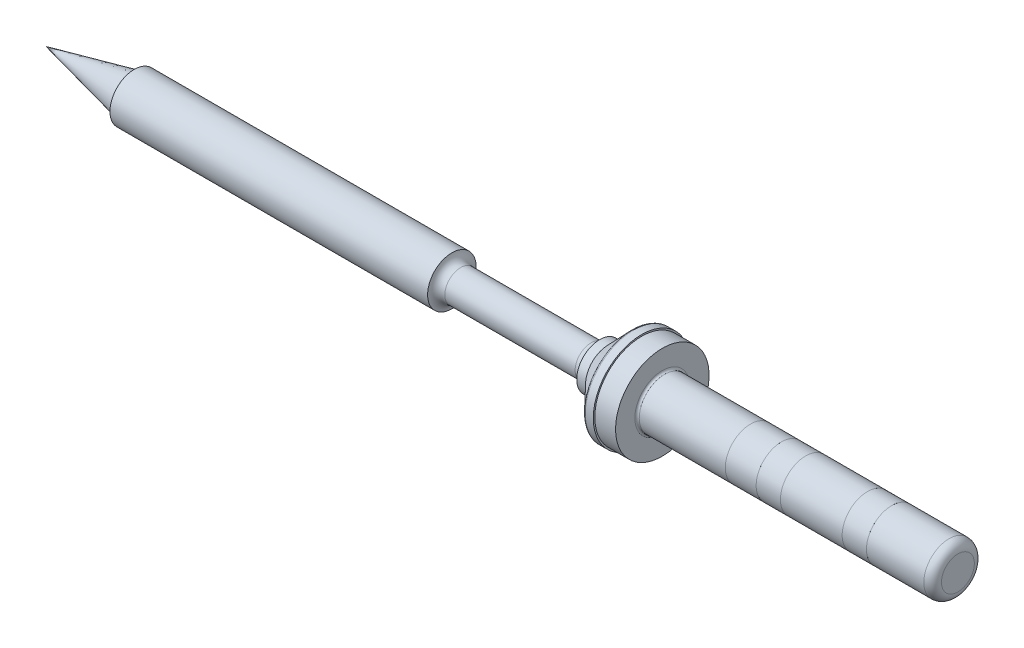
ISO-10303-21;
HEADER;
FILE_DESCRIPTION(('STEP AP214'),'2;1');
FILE_NAME('part.step','',(''),(''),'','','');
FILE_SCHEMA(('AUTOMOTIVE_DESIGN { 1 0 10303 214 1 1 1 1 }'));
ENDSEC;
DATA;
#1=APPLICATION_CONTEXT('core data for automotive mechanical design processes');
#2=APPLICATION_PROTOCOL_DEFINITION('international standard','automotive_design',2000,#1);
#3=PRODUCT_CONTEXT('',#1,'mechanical');
#4=PRODUCT('Part','Part','',(#3));
#5=PRODUCT_RELATED_PRODUCT_CATEGORY('part','',(#4));
#6=PRODUCT_DEFINITION_FORMATION('','',#4);
#7=PRODUCT_DEFINITION_CONTEXT('part definition',#1,'design');
#8=PRODUCT_DEFINITION('design','',#6,#7);
#9=PRODUCT_DEFINITION_SHAPE('','',#8);
#10=(LENGTH_UNIT() NAMED_UNIT(*) SI_UNIT(.MILLI.,.METRE.));
#11=(NAMED_UNIT(*) PLANE_ANGLE_UNIT() SI_UNIT($,.RADIAN.));
#12=(NAMED_UNIT(*) SI_UNIT($,.STERADIAN.) SOLID_ANGLE_UNIT());
#13=UNCERTAINTY_MEASURE_WITH_UNIT(LENGTH_MEASURE(1.E-05),#10,'distance_accuracy_value','');
#14=(GEOMETRIC_REPRESENTATION_CONTEXT(3) GLOBAL_UNCERTAINTY_ASSIGNED_CONTEXT((#13)) GLOBAL_UNIT_ASSIGNED_CONTEXT((#10,
#11,#12)) REPRESENTATION_CONTEXT('',''));
#15=CARTESIAN_POINT('',(0.,0.,0.));
#16=DIRECTION('',(0.,0.,1.));
#17=DIRECTION('',(1.,0.,0.));
#18=AXIS2_PLACEMENT_3D('',#15,#16,#17);
#19=CARTESIAN_POINT('',(33.5,2.865,0.));
#20=DIRECTION('',(-1.,0.,0.));
#21=DIRECTION('',(0.,0.,1.));
#22=AXIS2_PLACEMENT_3D('',#19,#20,#21);
#23=PLANE('',#22);
#24=CARTESIAN_POINT('',(33.5,0.,0.));
#25=DIRECTION('',(-1.,0.,0.));
#26=DIRECTION('',(0.,0.,1.));
#27=AXIS2_PLACEMENT_3D('',#24,#25,#26);
#28=CIRCLE('',#27,1.865);
#29=CARTESIAN_POINT('',(33.5,0.,1.865));
#30=VERTEX_POINT('',#29);
#31=CARTESIAN_POINT('',(33.5,0.,-1.865));
#32=VERTEX_POINT('',#31);
#33=EDGE_CURVE('P0_E37',#30,#32,#28,.T.);
#34=ORIENTED_EDGE('',*,*,#33,.F.);
#35=CARTESIAN_POINT('',(33.5,0.,0.));
#36=DIRECTION('',(-1.,0.,0.));
#37=DIRECTION('',(0.,0.,-1.));
#38=AXIS2_PLACEMENT_3D('',#35,#36,#37);
#39=CIRCLE('',#38,1.865);
#40=EDGE_CURVE('P0_E34',#32,#30,#39,.T.);
#41=ORIENTED_EDGE('',*,*,#40,.F.);
#42=EDGE_LOOP('',(#34,#41));
#43=FACE_BOUND('',#42,.T.);
#44=ADVANCED_FACE('P0_F17',(#43),#23,.F.);
#45=CARTESIAN_POINT('',(32.5,0.,0.));
#46=DIRECTION('',(-1.,0.,0.));
#47=DIRECTION('',(0.,0.,1.));
#48=AXIS2_PLACEMENT_3D('',#45,#46,#47);
#49=TOROIDAL_SURFACE('',#48,1.865,1.);
#50=CARTESIAN_POINT('',(32.5,0.,0.));
#51=DIRECTION('',(-1.,0.,0.));
#52=DIRECTION('',(0.,0.,1.));
#53=AXIS2_PLACEMENT_3D('',#50,#51,#52);
#54=CIRCLE('',#53,2.865);
#55=CARTESIAN_POINT('',(32.5,0.,2.865));
#56=VERTEX_POINT('',#55);
#57=EDGE_CURVE('P0_E27',#56,#56,#54,.T.);
#58=ORIENTED_EDGE('',*,*,#57,.F.);
#59=EDGE_LOOP('',(#58));
#60=FACE_BOUND('',#59,.T.);
#61=ORIENTED_EDGE('',*,*,#33,.T.);
#62=ORIENTED_EDGE('',*,*,#40,.T.);
#63=EDGE_LOOP('',(#61,#62));
#64=FACE_BOUND('',#63,.T.);
#65=ADVANCED_FACE('P0_F43',(#60,#64),#49,.T.);
#66=CARTESIAN_POINT('',(26.,0.,0.));
#67=DIRECTION('',(1.,0.,0.));
#68=DIRECTION('',(0.,0.,-1.));
#69=AXIS2_PLACEMENT_3D('',#66,#67,#68);
#70=PLANE('',#69);
#71=CARTESIAN_POINT('',(26.,0.,0.));
#72=DIRECTION('',(-1.,0.,0.));
#73=DIRECTION('',(0.,0.,1.));
#74=AXIS2_PLACEMENT_3D('',#71,#72,#73);
#75=CIRCLE('',#74,2.865);
#76=CARTESIAN_POINT('',(26.,0.,2.865));
#77=VERTEX_POINT('',#76);
#78=EDGE_CURVE('P0_E11',#77,#77,#75,.F.);
#79=ORIENTED_EDGE('',*,*,#78,.F.);
#80=EDGE_LOOP('',(#79));
#81=FACE_BOUND('',#80,.T.);
#82=ADVANCED_FACE('P0_F56',(#81),#70,.F.);
#83=CARTESIAN_POINT('',(0.,0.,0.));
#84=DIRECTION('',(-1.,0.,0.));
#85=DIRECTION('',(0.,0.,1.));
#86=AXIS2_PLACEMENT_3D('',#83,#84,#85);
#87=CYLINDRICAL_SURFACE('',#86,2.865);
#88=ORIENTED_EDGE('',*,*,#78,.T.);
#89=EDGE_LOOP('',(#88));
#90=FACE_BOUND('',#89,.T.);
#91=ORIENTED_EDGE('',*,*,#57,.T.);
#92=EDGE_LOOP('',(#91));
#93=FACE_BOUND('',#92,.T.);
#94=ADVANCED_FACE('P0_F65',(#90,#93),#87,.T.);
#95=CLOSED_SHELL('',(#44,#65,#82,#94));
#96=MANIFOLD_SOLID_BREP('P0_B1',#95);
#97=CARTESIAN_POINT('',(10.,0.,0.));
#98=DIRECTION('',(-1.,0.,0.));
#99=DIRECTION('',(0.,0.,1.));
#100=AXIS2_PLACEMENT_3D('',#97,#98,#99);
#101=PLANE('',#100);
#102=CARTESIAN_POINT('',(9.99999999999999,0.,0.));
#103=DIRECTION('',(-1.,0.,0.));
#104=DIRECTION('',(0.,0.,1.));
#105=AXIS2_PLACEMENT_3D('',#102,#103,#104);
#106=CIRCLE('',#105,2.865);
#107=CARTESIAN_POINT('',(9.99999999999999,0.,2.865));
#108=VERTEX_POINT('',#107);
#109=EDGE_CURVE('P1_E93',#108,#108,#106,.T.);
#110=ORIENTED_EDGE('',*,*,#109,.F.);
#111=EDGE_LOOP('',(#110));
#112=FACE_BOUND('',#111,.T.);
#113=ADVANCED_FACE('P1_F17',(#112),#101,.F.);
#114=CARTESIAN_POINT('',(-75.7230441218485,0.,0.));
#115=DIRECTION('',(-1.,0.,0.));
#116=DIRECTION('',(0.,0.,1.));
#117=AXIS2_PLACEMENT_3D('',#114,#115,#116);
#118=CYLINDRICAL_SURFACE('',#117,2.865);
#119=CARTESIAN_POINT('',(0.25,0.,0.));
#120=DIRECTION('',(-1.,0.,0.));
#121=DIRECTION('',(0.,0.,1.));
#122=AXIS2_PLACEMENT_3D('',#119,#120,#121);
#123=CIRCLE('',#122,2.865);
#124=CARTESIAN_POINT('',(0.25,0.,2.865));
#125=VERTEX_POINT('',#124);
#126=EDGE_CURVE('P1_E51',#125,#125,#123,.F.);
#127=ORIENTED_EDGE('',*,*,#126,.T.);
#128=EDGE_LOOP('',(#127));
#129=FACE_BOUND('',#128,.T.);
#130=ORIENTED_EDGE('',*,*,#109,.T.);
#131=EDGE_LOOP('',(#130));
#132=FACE_BOUND('',#131,.T.);
#133=ADVANCED_FACE('P1_F82',(#129,#132),#118,.T.);
#134=CARTESIAN_POINT('',(0.25,0.,0.));
#135=DIRECTION('',(-1.,0.,0.));
#136=DIRECTION('',(0.,0.,1.));
#137=AXIS2_PLACEMENT_3D('',#134,#135,#136);
#138=TOROIDAL_SURFACE('',#137,3.115,0.25);
#139=CARTESIAN_POINT('',(0.,0.,0.));
#140=DIRECTION('',(1.,0.,0.));
#141=DIRECTION('',(0.,0.,-1.));
#142=AXIS2_PLACEMENT_3D('',#139,#140,#141);
#143=CIRCLE('',#142,3.115);
#144=CARTESIAN_POINT('',(0.,0.,-3.115));
#145=VERTEX_POINT('',#144);
#146=CARTESIAN_POINT('',(0.,0.,3.115));
#147=VERTEX_POINT('',#146);
#148=EDGE_CURVE('P1_E40',#145,#147,#143,.T.);
#149=ORIENTED_EDGE('',*,*,#148,.T.);
#150=CARTESIAN_POINT('',(0.,0.,0.));
#151=DIRECTION('',(1.,0.,0.));
#152=DIRECTION('',(0.,0.,1.));
#153=AXIS2_PLACEMENT_3D('',#150,#151,#152);
#154=CIRCLE('',#153,3.115);
#155=EDGE_CURVE('P1_E38',#147,#145,#154,.T.);
#156=ORIENTED_EDGE('',*,*,#155,.T.);
#157=EDGE_LOOP('',(#149,#156));
#158=FACE_BOUND('',#157,.T.);
#159=ORIENTED_EDGE('',*,*,#126,.F.);
#160=EDGE_LOOP('',(#159));
#161=FACE_BOUND('',#160,.T.);
#162=ADVANCED_FACE('P1_F42',(#158,#161),#138,.F.);
#163=CARTESIAN_POINT('',(0.,2.865,0.));
#164=DIRECTION('',(-1.,0.,0.));
#165=DIRECTION('',(0.,0.,1.));
#166=AXIS2_PLACEMENT_3D('',#163,#164,#165);
#167=PLANE('',#166);
#168=CARTESIAN_POINT('',(0.,0.,0.));
#169=DIRECTION('',(-1.,0.,0.));
#170=DIRECTION('',(0.,0.,1.));
#171=AXIS2_PLACEMENT_3D('',#168,#169,#170);
#172=CIRCLE('',#171,5.3);
#173=CARTESIAN_POINT('',(0.,0.,5.3));
#174=VERTEX_POINT('',#173);
#175=EDGE_CURVE('P1_E46',#174,#174,#172,.T.);
#176=ORIENTED_EDGE('',*,*,#175,.F.);
#177=EDGE_LOOP('',(#176));
#178=FACE_BOUND('',#177,.T.);
#179=ORIENTED_EDGE('',*,*,#155,.F.);
#180=ORIENTED_EDGE('',*,*,#148,.F.);
#181=EDGE_LOOP('',(#179,#180));
#182=FACE_BOUND('',#181,.T.);
#183=ADVANCED_FACE('P1_F50',(#178,#182),#167,.F.);
#184=CARTESIAN_POINT('',(-75.7230441218485,0.,0.));
#185=DIRECTION('',(-1.,0.,0.));
#186=DIRECTION('',(0.,0.,1.));
#187=AXIS2_PLACEMENT_3D('',#184,#185,#186);
#188=CYLINDRICAL_SURFACE('',#187,5.3);
#189=CARTESIAN_POINT('',(-2.35,0.,0.));
#190=DIRECTION('',(-1.,0.,0.));
#191=DIRECTION('',(0.,0.,1.));
#192=AXIS2_PLACEMENT_3D('',#189,#190,#191);
#193=CIRCLE('',#192,5.3);
#194=CARTESIAN_POINT('',(-2.35,0.,5.3));
#195=VERTEX_POINT('',#194);
#196=EDGE_CURVE('P1_E102',#195,#195,#193,.F.);
#197=ORIENTED_EDGE('',*,*,#196,.T.);
#198=EDGE_LOOP('',(#197));
#199=FACE_BOUND('',#198,.T.);
#200=ORIENTED_EDGE('',*,*,#175,.T.);
#201=EDGE_LOOP('',(#200));
#202=FACE_BOUND('',#201,.T.);
#203=ADVANCED_FACE('P1_F68',(#199,#202),#188,.T.);
#204=CARTESIAN_POINT('',(-2.35,5.3,0.));
#205=DIRECTION('',(-1.,0.,0.));
#206=DIRECTION('',(0.,0.,1.));
#207=AXIS2_PLACEMENT_3D('',#204,#205,#206);
#208=PLANE('',#207);
#209=ORIENTED_EDGE('',*,*,#196,.F.);
#210=EDGE_LOOP('',(#209));
#211=FACE_BOUND('',#210,.T.);
#212=CARTESIAN_POINT('',(-2.35,0.,0.));
#213=DIRECTION('',(-1.,0.,0.));
#214=DIRECTION('',(0.,0.,1.));
#215=AXIS2_PLACEMENT_3D('',#212,#213,#214);
#216=CIRCLE('',#215,5.475);
#217=CARTESIAN_POINT('',(-2.35,0.,5.475));
#218=VERTEX_POINT('',#217);
#219=EDGE_CURVE('P1_E99',#218,#218,#216,.T.);
#220=ORIENTED_EDGE('',*,*,#219,.F.);
#221=EDGE_LOOP('',(#220));
#222=FACE_BOUND('',#221,.T.);
#223=ADVANCED_FACE('P1_F249',(#211,#222),#208,.F.);
#224=CARTESIAN_POINT('',(-75.7230441218485,0.,0.));
#225=DIRECTION('',(-1.,0.,0.));
#226=DIRECTION('',(0.,0.,1.));
#227=AXIS2_PLACEMENT_3D('',#224,#225,#226);
#228=CYLINDRICAL_SURFACE('',#227,5.475);
#229=CARTESIAN_POINT('',(-3.24317759863393,0.,0.));
#230=DIRECTION('',(1.,0.,0.));
#231=DIRECTION('',(0.,0.,-1.));
#232=AXIS2_PLACEMENT_3D('',#229,#230,#231);
#233=CIRCLE('',#232,5.475);
#234=CARTESIAN_POINT('',(-3.24317759863393,0.,-5.475));
#235=VERTEX_POINT('',#234);
#236=EDGE_CURVE('P1_E54',#235,#235,#233,.F.);
#237=ORIENTED_EDGE('',*,*,#236,.F.);
#238=EDGE_LOOP('',(#237));
#239=FACE_BOUND('',#238,.T.);
#240=ORIENTED_EDGE('',*,*,#219,.T.);
#241=EDGE_LOOP('',(#240));
#242=FACE_BOUND('',#241,.T.);
#243=ADVANCED_FACE('P1_F165',(#239,#242),#228,.T.);
#244=CARTESIAN_POINT('',(-3.24317759863393,0.,0.));
#245=DIRECTION('',(1.,0.,0.));
#246=DIRECTION('',(0.,0.,-1.));
#247=AXIS2_PLACEMENT_3D('',#244,#245,#246);
#248=TOROIDAL_SURFACE('',#247,5.225,0.25);
#249=ORIENTED_EDGE('',*,*,#236,.T.);
#250=EDGE_LOOP('',(#249));
#251=FACE_BOUND('',#250,.T.);
#252=CARTESIAN_POINT('',(-3.42383806287216,0.,0.));
#253=DIRECTION('',(1.,0.,0.));
#254=DIRECTION('',(0.,0.,-1.));
#255=AXIS2_PLACEMENT_3D('',#252,#253,#254);
#256=CIRCLE('',#255,5.39780566157333);
#257=CARTESIAN_POINT('',(-3.42383806287216,0.,-5.39780566157333));
#258=VERTEX_POINT('',#257);
#259=EDGE_CURVE('P1_E169',#258,#258,#256,.F.);
#260=ORIENTED_EDGE('',*,*,#259,.F.);
#261=EDGE_LOOP('',(#260));
#262=FACE_BOUND('',#261,.T.);
#263=ADVANCED_FACE('P1_F161',(#251,#262),#248,.T.);
#264=CARTESIAN_POINT('',(-3.42383806298585,0.,0.));
#265=DIRECTION('',(1.,0.,0.));
#266=DIRECTION('',(0.,0.,-1.));
#267=AXIS2_PLACEMENT_3D('',#264,#265,#266);
#268=CONICAL_SURFACE('',#267,5.39780566145964,0.807616728723706);
#269=ORIENTED_EDGE('',*,*,#259,.T.);
#270=EDGE_LOOP('',(#269));
#271=FACE_BOUND('',#270,.T.);
#272=CARTESIAN_POINT('',(-6.09999999999999,0.,0.));
#273=DIRECTION('',(-1.,0.,0.));
#274=DIRECTION('',(0.,0.,1.));
#275=AXIS2_PLACEMENT_3D('',#272,#273,#274);
#276=CIRCLE('',#275,2.6);
#277=CARTESIAN_POINT('',(-6.09999999999999,0.,2.6));
#278=VERTEX_POINT('',#277);
#279=EDGE_CURVE('P1_E171',#278,#278,#276,.T.);
#280=ORIENTED_EDGE('',*,*,#279,.F.);
#281=EDGE_LOOP('',(#280));
#282=FACE_BOUND('',#281,.T.);
#283=ADVANCED_FACE('P1_F157',(#271,#282),#268,.T.);
#284=CARTESIAN_POINT('',(-75.7230441218485,0.,0.));
#285=DIRECTION('',(-1.,0.,0.));
#286=DIRECTION('',(0.,0.,1.));
#287=AXIS2_PLACEMENT_3D('',#284,#285,#286);
#288=CYLINDRICAL_SURFACE('',#287,2.6);
#289=CARTESIAN_POINT('',(-7.1,0.,0.));
#290=DIRECTION('',(1.,0.,0.));
#291=DIRECTION('',(0.,0.,-1.));
#292=AXIS2_PLACEMENT_3D('',#289,#290,#291);
#293=CIRCLE('',#292,2.6);
#294=CARTESIAN_POINT('',(-7.1,0.,-2.6));
#295=VERTEX_POINT('',#294);
#296=EDGE_CURVE('P1_E144',#295,#295,#293,.T.);
#297=ORIENTED_EDGE('',*,*,#296,.T.);
#298=EDGE_LOOP('',(#297));
#299=FACE_BOUND('',#298,.T.);
#300=ORIENTED_EDGE('',*,*,#279,.T.);
#301=EDGE_LOOP('',(#300));
#302=FACE_BOUND('',#301,.T.);
#303=ADVANCED_FACE('P1_F153',(#299,#302),#288,.T.);
#304=CARTESIAN_POINT('',(-8.07979589711327,0.,0.));
#305=DIRECTION('',(1.,0.,0.));
#306=DIRECTION('',(0.,0.,-1.));
#307=AXIS2_PLACEMENT_3D('',#304,#305,#306);
#308=TOROIDAL_SURFACE('',#307,2.8,1.);
#309=ORIENTED_EDGE('',*,*,#296,.F.);
#310=EDGE_LOOP('',(#309));
#311=FACE_BOUND('',#310,.T.);
#312=CARTESIAN_POINT('',(-8.07979589711326,0.,0.));
#313=DIRECTION('',(-1.,0.,0.));
#314=DIRECTION('',(0.,0.,1.));
#315=AXIS2_PLACEMENT_3D('',#312,#313,#314);
#316=CIRCLE('',#315,1.8);
#317=CARTESIAN_POINT('',(-8.07979589711326,0.,1.8));
#318=VERTEX_POINT('',#317);
#319=EDGE_CURVE('P1_E141',#318,#318,#316,.T.);
#320=ORIENTED_EDGE('',*,*,#319,.F.);
#321=EDGE_LOOP('',(#320));
#322=FACE_BOUND('',#321,.T.);
#323=ADVANCED_FACE('P1_F149',(#311,#322),#308,.F.);
#324=CARTESIAN_POINT('',(-75.7230441218485,0.,0.));
#325=DIRECTION('',(-1.,0.,0.));
#326=DIRECTION('',(0.,0.,1.));
#327=AXIS2_PLACEMENT_3D('',#324,#325,#326);
#328=CYLINDRICAL_SURFACE('',#327,1.8);
#329=CARTESIAN_POINT('',(-22.8512507822281,0.,0.));
#330=DIRECTION('',(-1.,0.,0.));
#331=DIRECTION('',(0.,0.,1.));
#332=AXIS2_PLACEMENT_3D('',#329,#330,#331);
#333=CIRCLE('',#332,1.8);
#334=CARTESIAN_POINT('',(-22.8512507822281,0.,1.8));
#335=VERTEX_POINT('',#334);
#336=EDGE_CURVE('P1_E98',#335,#335,#333,.F.);
#337=ORIENTED_EDGE('',*,*,#336,.T.);
#338=EDGE_LOOP('',(#337));
#339=FACE_BOUND('',#338,.T.);
#340=ORIENTED_EDGE('',*,*,#319,.T.);
#341=EDGE_LOOP('',(#340));
#342=FACE_BOUND('',#341,.T.);
#343=ADVANCED_FACE('P1_F152',(#339,#342),#328,.T.);
#344=CARTESIAN_POINT('',(-59.8499999999831,0.,0.));
#345=DIRECTION('',(1.,0.,0.));
#346=DIRECTION('',(0.,0.,-1.));
#347=AXIS2_PLACEMENT_3D('',#344,#345,#346);
#348=CONICAL_SURFACE('',#347,2.25000000000364,0.221314442331695);
#349=CARTESIAN_POINT('',(-69.8500000000308,0.,0.));
#350=VERTEX_POINT('',#349);
#351=VERTEX_LOOP('',#350);
#352=FACE_BOUND('',#351,.T.);
#353=CARTESIAN_POINT('',(-59.8499999999831,0.,0.));
#354=DIRECTION('',(1.,0.,0.));
#355=DIRECTION('',(0.,0.,-1.));
#356=AXIS2_PLACEMENT_3D('',#353,#354,#355);
#357=CIRCLE('',#356,2.25000000000364);
#358=CARTESIAN_POINT('',(-59.8499999999831,0.,-2.25000000000364));
#359=VERTEX_POINT('',#358);
#360=EDGE_CURVE('P1_E95',#359,#359,#357,.F.);
#361=ORIENTED_EDGE('',*,*,#360,.T.);
#362=EDGE_LOOP('',(#361));
#363=FACE_BOUND('',#362,.T.);
#364=ADVANCED_FACE('P1_F133',(#352,#363),#348,.T.);
#365=CARTESIAN_POINT('',(-22.8512507822281,0.,0.));
#366=DIRECTION('',(-1.,0.,0.));
#367=DIRECTION('',(0.,0.,1.));
#368=AXIS2_PLACEMENT_3D('',#365,#366,#367);
#369=TOROIDAL_SURFACE('',#368,2.8,1.);
#370=CARTESIAN_POINT('',(-23.85,0.,0.));
#371=DIRECTION('',(-1.,0.,0.));
#372=DIRECTION('',(0.,0.,1.));
#373=AXIS2_PLACEMENT_3D('',#370,#371,#372);
#374=CIRCLE('',#373,2.75);
#375=CARTESIAN_POINT('',(-23.85,0.,2.75));
#376=VERTEX_POINT('',#375);
#377=EDGE_CURVE('P1_E28',#376,#376,#374,.T.);
#378=ORIENTED_EDGE('',*,*,#377,.F.);
#379=EDGE_LOOP('',(#378));
#380=FACE_BOUND('',#379,.T.);
#381=ORIENTED_EDGE('',*,*,#336,.F.);
#382=EDGE_LOOP('',(#381));
#383=FACE_BOUND('',#382,.T.);
#384=ADVANCED_FACE('P1_F125',(#380,#383),#369,.F.);
#385=CARTESIAN_POINT('',(-59.85,2.75,0.));
#386=DIRECTION('',(1.,0.,0.));
#387=DIRECTION('',(0.,0.,-1.));
#388=AXIS2_PLACEMENT_3D('',#385,#386,#387);
#389=PLANE('',#388);
#390=CARTESIAN_POINT('',(-59.85,0.,0.));
#391=DIRECTION('',(-1.,0.,0.));
#392=DIRECTION('',(0.,0.,1.));
#393=AXIS2_PLACEMENT_3D('',#390,#391,#392);
#394=CIRCLE('',#393,2.75);
#395=CARTESIAN_POINT('',(-59.85,0.,2.75));
#396=VERTEX_POINT('',#395);
#397=EDGE_CURVE('P1_E11',#396,#396,#394,.F.);
#398=ORIENTED_EDGE('',*,*,#397,.F.);
#399=EDGE_LOOP('',(#398));
#400=FACE_BOUND('',#399,.T.);
#401=ORIENTED_EDGE('',*,*,#360,.F.);
#402=EDGE_LOOP('',(#401));
#403=FACE_BOUND('',#402,.T.);
#404=ADVANCED_FACE('P1_F119',(#400,#403),#389,.F.);
#405=CARTESIAN_POINT('',(-75.7230441218485,0.,0.));
#406=DIRECTION('',(-1.,0.,0.));
#407=DIRECTION('',(0.,0.,1.));
#408=AXIS2_PLACEMENT_3D('',#405,#406,#407);
#409=CYLINDRICAL_SURFACE('',#408,2.75);
#410=ORIENTED_EDGE('',*,*,#397,.T.);
#411=EDGE_LOOP('',(#410));
#412=FACE_BOUND('',#411,.T.);
#413=ORIENTED_EDGE('',*,*,#377,.T.);
#414=EDGE_LOOP('',(#413));
#415=FACE_BOUND('',#414,.T.);
#416=ADVANCED_FACE('P1_F117',(#412,#415),#409,.T.);
#417=CLOSED_SHELL('',(#113,#133,#162,#183,#203,#223,#243,#263,#283,#303,#323,#343,#364,#384,
#404,#416));
#418=MANIFOLD_SOLID_BREP('P1_B1',#417);
#419=CARTESIAN_POINT('',(23.25,2.865,0.));
#420=DIRECTION('',(-1.,0.,0.));
#421=DIRECTION('',(0.,0.,1.));
#422=AXIS2_PLACEMENT_3D('',#419,#420,#421);
#423=PLANE('',#422);
#424=CARTESIAN_POINT('',(23.25,0.,0.));
#425=DIRECTION('',(1.,0.,0.));
#426=DIRECTION('',(0.,0.,-1.));
#427=AXIS2_PLACEMENT_3D('',#424,#425,#426);
#428=CIRCLE('',#427,2.865);
#429=CARTESIAN_POINT('',(23.25,0.,-2.865));
#430=VERTEX_POINT('',#429);
#431=EDGE_CURVE('P2_E18',#430,#430,#428,.T.);
#432=ORIENTED_EDGE('',*,*,#431,.F.);
#433=EDGE_LOOP('',(#432));
#434=FACE_BOUND('',#433,.T.);
#435=ADVANCED_FACE('P2_F15',(#434),#423,.T.);
#436=CARTESIAN_POINT('',(13.5,0.,0.));
#437=DIRECTION('',(1.,0.,0.));
#438=DIRECTION('',(0.,0.,-1.));
#439=AXIS2_PLACEMENT_3D('',#436,#437,#438);
#440=CYLINDRICAL_SURFACE('',#439,2.865);
#441=ORIENTED_EDGE('',*,*,#431,.T.);
#442=EDGE_LOOP('',(#441));
#443=FACE_BOUND('',#442,.T.);
#444=CARTESIAN_POINT('',(26.,0.,0.));
#445=DIRECTION('',(1.,0.,0.));
#446=DIRECTION('',(0.,0.,-1.));
#447=AXIS2_PLACEMENT_3D('',#444,#445,#446);
#448=CIRCLE('',#447,2.865);
#449=CARTESIAN_POINT('',(26.,0.,-2.865));
#450=VERTEX_POINT('',#449);
#451=EDGE_CURVE('P2_E10',#450,#450,#448,.T.);
#452=ORIENTED_EDGE('',*,*,#451,.F.);
#453=EDGE_LOOP('',(#452));
#454=FACE_BOUND('',#453,.T.);
#455=ADVANCED_FACE('P2_F27',(#443,#454),#440,.T.);
#456=CARTESIAN_POINT('',(26.,0.,0.));
#457=DIRECTION('',(1.,0.,0.));
#458=DIRECTION('',(0.,0.,-1.));
#459=AXIS2_PLACEMENT_3D('',#456,#457,#458);
#460=PLANE('',#459);
#461=ORIENTED_EDGE('',*,*,#451,.T.);
#462=EDGE_LOOP('',(#461));
#463=FACE_BOUND('',#462,.T.);
#464=ADVANCED_FACE('P2_F35',(#463),#460,.T.);
#465=CLOSED_SHELL('',(#435,#455,#464));
#466=MANIFOLD_SOLID_BREP('P2_B1',#465);
#467=CARTESIAN_POINT('',(23.25,2.865,0.));
#468=DIRECTION('',(-1.,0.,0.));
#469=DIRECTION('',(0.,0.,1.));
#470=AXIS2_PLACEMENT_3D('',#467,#468,#469);
#471=PLANE('',#470);
#472=CARTESIAN_POINT('',(23.25,0.,0.));
#473=DIRECTION('',(-1.,0.,0.));
#474=DIRECTION('',(0.,0.,1.));
#475=AXIS2_PLACEMENT_3D('',#472,#473,#474);
#476=CIRCLE('',#475,2.865);
#477=CARTESIAN_POINT('',(23.25,0.,2.865));
#478=VERTEX_POINT('',#477);
#479=EDGE_CURVE('P3_E17',#478,#478,#476,.T.);
#480=ORIENTED_EDGE('',*,*,#479,.F.);
#481=EDGE_LOOP('',(#480));
#482=FACE_BOUND('',#481,.T.);
#483=ADVANCED_FACE('P3_F14',(#482),#471,.F.);
#484=CARTESIAN_POINT('',(16.25,0.,0.));
#485=DIRECTION('',(1.,0.,0.));
#486=DIRECTION('',(0.,0.,-1.));
#487=AXIS2_PLACEMENT_3D('',#484,#485,#486);
#488=PLANE('',#487);
#489=CARTESIAN_POINT('',(16.25,0.,0.));
#490=DIRECTION('',(-1.,0.,0.));
#491=DIRECTION('',(0.,0.,1.));
#492=AXIS2_PLACEMENT_3D('',#489,#490,#491);
#493=CIRCLE('',#492,2.865);
#494=CARTESIAN_POINT('',(16.25,0.,2.865));
#495=VERTEX_POINT('',#494);
#496=EDGE_CURVE('P3_E9',#495,#495,#493,.F.);
#497=ORIENTED_EDGE('',*,*,#496,.F.);
#498=EDGE_LOOP('',(#497));
#499=FACE_BOUND('',#498,.T.);
#500=ADVANCED_FACE('P3_F29',(#499),#488,.F.);
#501=CARTESIAN_POINT('',(0.,0.,0.));
#502=DIRECTION('',(-1.,0.,0.));
#503=DIRECTION('',(0.,0.,1.));
#504=AXIS2_PLACEMENT_3D('',#501,#502,#503);
#505=CYLINDRICAL_SURFACE('',#504,2.865);
#506=ORIENTED_EDGE('',*,*,#496,.T.);
#507=EDGE_LOOP('',(#506));
#508=FACE_BOUND('',#507,.T.);
#509=ORIENTED_EDGE('',*,*,#479,.T.);
#510=EDGE_LOOP('',(#509));
#511=FACE_BOUND('',#510,.T.);
#512=ADVANCED_FACE('P3_F26',(#508,#511),#505,.T.);
#513=CLOSED_SHELL('',(#483,#500,#512));
#514=MANIFOLD_SOLID_BREP('P3_B1',#513);
#515=CARTESIAN_POINT('',(13.5,2.865,0.));
#516=DIRECTION('',(-1.,0.,0.));
#517=DIRECTION('',(0.,0.,1.));
#518=AXIS2_PLACEMENT_3D('',#515,#516,#517);
#519=PLANE('',#518);
#520=CARTESIAN_POINT('',(13.5,0.,0.));
#521=DIRECTION('',(-1.,0.,0.));
#522=DIRECTION('',(0.,0.,1.));
#523=AXIS2_PLACEMENT_3D('',#520,#521,#522);
#524=CIRCLE('',#523,2.865);
#525=CARTESIAN_POINT('',(13.5,0.,2.865));
#526=VERTEX_POINT('',#525);
#527=EDGE_CURVE('P4_E18',#526,#526,#524,.T.);
#528=ORIENTED_EDGE('',*,*,#527,.F.);
#529=EDGE_LOOP('',(#528));
#530=FACE_BOUND('',#529,.T.);
#531=ADVANCED_FACE('P4_F15',(#530),#519,.F.);
#532=CARTESIAN_POINT('',(9.99999999999999,0.,0.));
#533=DIRECTION('',(1.,0.,0.));
#534=DIRECTION('',(0.,0.,-1.));
#535=AXIS2_PLACEMENT_3D('',#532,#533,#534);
#536=PLANE('',#535);
#537=CARTESIAN_POINT('',(9.99999999999999,0.,0.));
#538=DIRECTION('',(-1.,0.,0.));
#539=DIRECTION('',(0.,0.,1.));
#540=AXIS2_PLACEMENT_3D('',#537,#538,#539);
#541=CIRCLE('',#540,2.865);
#542=CARTESIAN_POINT('',(9.99999999999999,0.,2.865));
#543=VERTEX_POINT('',#542);
#544=EDGE_CURVE('P4_E10',#543,#543,#541,.F.);
#545=ORIENTED_EDGE('',*,*,#544,.F.);
#546=EDGE_LOOP('',(#545));
#547=FACE_BOUND('',#546,.T.);
#548=ADVANCED_FACE('P4_F30',(#547),#536,.F.);
#549=CARTESIAN_POINT('',(0.,0.,0.));
#550=DIRECTION('',(-1.,0.,0.));
#551=DIRECTION('',(0.,0.,1.));
#552=AXIS2_PLACEMENT_3D('',#549,#550,#551);
#553=CYLINDRICAL_SURFACE('',#552,2.865);
#554=ORIENTED_EDGE('',*,*,#544,.T.);
#555=EDGE_LOOP('',(#554));
#556=FACE_BOUND('',#555,.T.);
#557=ORIENTED_EDGE('',*,*,#527,.T.);
#558=EDGE_LOOP('',(#557));
#559=FACE_BOUND('',#558,.T.);
#560=ADVANCED_FACE('P4_F27',(#556,#559),#553,.T.);
#561=CLOSED_SHELL('',(#531,#548,#560));
#562=MANIFOLD_SOLID_BREP('P4_B1',#561);
#563=CARTESIAN_POINT('',(13.5,2.865,0.));
#564=DIRECTION('',(-1.,0.,0.));
#565=DIRECTION('',(0.,0.,1.));
#566=AXIS2_PLACEMENT_3D('',#563,#564,#565);
#567=PLANE('',#566);
#568=CARTESIAN_POINT('',(13.5,0.,0.));
#569=DIRECTION('',(1.,0.,0.));
#570=DIRECTION('',(0.,0.,-1.));
#571=AXIS2_PLACEMENT_3D('',#568,#569,#570);
#572=CIRCLE('',#571,2.865);
#573=CARTESIAN_POINT('',(13.5,0.,-2.865));
#574=VERTEX_POINT('',#573);
#575=EDGE_CURVE('P5_E18',#574,#574,#572,.T.);
#576=ORIENTED_EDGE('',*,*,#575,.F.);
#577=EDGE_LOOP('',(#576));
#578=FACE_BOUND('',#577,.T.);
#579=ADVANCED_FACE('P5_F15',(#578),#567,.T.);
#580=CARTESIAN_POINT('',(13.5,0.,0.));
#581=DIRECTION('',(1.,0.,0.));
#582=DIRECTION('',(0.,0.,-1.));
#583=AXIS2_PLACEMENT_3D('',#580,#581,#582);
#584=CYLINDRICAL_SURFACE('',#583,2.865);
#585=ORIENTED_EDGE('',*,*,#575,.T.);
#586=EDGE_LOOP('',(#585));
#587=FACE_BOUND('',#586,.T.);
#588=CARTESIAN_POINT('',(16.25,0.,0.));
#589=DIRECTION('',(1.,0.,0.));
#590=DIRECTION('',(0.,0.,-1.));
#591=AXIS2_PLACEMENT_3D('',#588,#589,#590);
#592=CIRCLE('',#591,2.865);
#593=CARTESIAN_POINT('',(16.25,0.,-2.865));
#594=VERTEX_POINT('',#593);
#595=EDGE_CURVE('P5_E10',#594,#594,#592,.T.);
#596=ORIENTED_EDGE('',*,*,#595,.F.);
#597=EDGE_LOOP('',(#596));
#598=FACE_BOUND('',#597,.T.);
#599=ADVANCED_FACE('P5_F27',(#587,#598),#584,.T.);
#600=CARTESIAN_POINT('',(16.25,0.,0.));
#601=DIRECTION('',(1.,0.,0.));
#602=DIRECTION('',(0.,0.,-1.));
#603=AXIS2_PLACEMENT_3D('',#600,#601,#602);
#604=PLANE('',#603);
#605=ORIENTED_EDGE('',*,*,#595,.T.);
#606=EDGE_LOOP('',(#605));
#607=FACE_BOUND('',#606,.T.);
#608=ADVANCED_FACE('P5_F35',(#607),#604,.T.);
#609=CLOSED_SHELL('',(#579,#599,#608));
#610=MANIFOLD_SOLID_BREP('P5_B1',#609);
#611=ADVANCED_BREP_SHAPE_REPRESENTATION('',(#18,#96,#418,#466,#514,#562,#610),#14);
#612=SHAPE_DEFINITION_REPRESENTATION(#9,#611);
ENDSEC;
END-ISO-10303-21;
